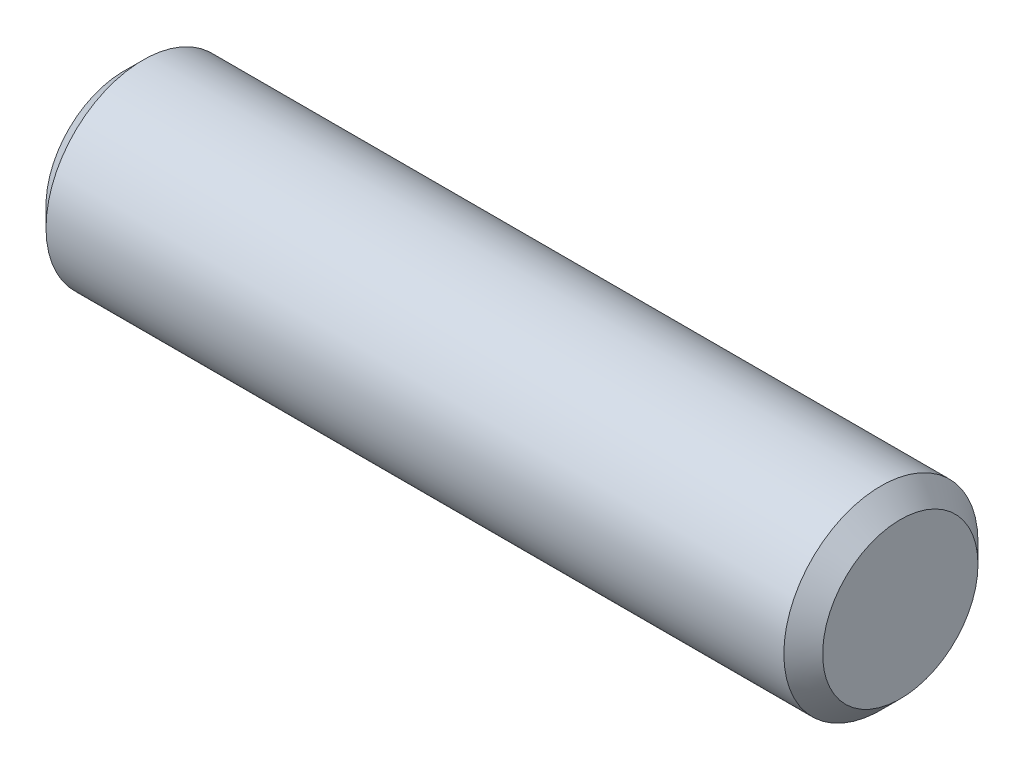
ISO-10303-21;
HEADER;
FILE_DESCRIPTION(('STEP AP214'),'2;1');
FILE_NAME('part.step','',(''),(''),'','','');
FILE_SCHEMA(('AUTOMOTIVE_DESIGN { 1 0 10303 214 1 1 1 1 }'));
ENDSEC;
DATA;
#1=APPLICATION_CONTEXT('core data for automotive mechanical design processes');
#2=APPLICATION_PROTOCOL_DEFINITION('international standard','automotive_design',2000,#1);
#3=PRODUCT_CONTEXT('',#1,'mechanical');
#4=PRODUCT('Part','Part','',(#3));
#5=PRODUCT_RELATED_PRODUCT_CATEGORY('part','',(#4));
#6=PRODUCT_DEFINITION_FORMATION('','',#4);
#7=PRODUCT_DEFINITION_CONTEXT('part definition',#1,'design');
#8=PRODUCT_DEFINITION('design','',#6,#7);
#9=PRODUCT_DEFINITION_SHAPE('','',#8);
#10=(LENGTH_UNIT() NAMED_UNIT(*) SI_UNIT(.MILLI.,.METRE.));
#11=(NAMED_UNIT(*) PLANE_ANGLE_UNIT() SI_UNIT($,.RADIAN.));
#12=(NAMED_UNIT(*) SI_UNIT($,.STERADIAN.) SOLID_ANGLE_UNIT());
#13=UNCERTAINTY_MEASURE_WITH_UNIT(LENGTH_MEASURE(1.E-05),#10,'distance_accuracy_value','');
#14=(GEOMETRIC_REPRESENTATION_CONTEXT(3) GLOBAL_UNCERTAINTY_ASSIGNED_CONTEXT((#13)) GLOBAL_UNIT_ASSIGNED_CONTEXT((#10,
#11,#12)) REPRESENTATION_CONTEXT('',''));
#15=CARTESIAN_POINT('',(0.,0.,0.));
#16=DIRECTION('',(0.,0.,1.));
#17=DIRECTION('',(1.,0.,0.));
#18=AXIS2_PLACEMENT_3D('',#15,#16,#17);
#19=CARTESIAN_POINT('',(-12.7,0.,0.));
#20=DIRECTION('',(1.,0.,0.));
#21=DIRECTION('',(0.,0.,-1.));
#22=AXIS2_PLACEMENT_3D('',#19,#20,#21);
#23=CYLINDRICAL_SURFACE('',#22,3.175);
#24=CARTESIAN_POINT('',(12.065,0.,0.));
#25=DIRECTION('',(1.,0.,0.));
#26=DIRECTION('',(0.,0.,-1.));
#27=AXIS2_PLACEMENT_3D('',#24,#25,#26);
#28=CIRCLE('',#27,3.175);
#29=CARTESIAN_POINT('',(12.065,0.,-3.175));
#30=VERTEX_POINT('',#29);
#31=EDGE_CURVE('E54',#30,#30,#28,.F.);
#32=ORIENTED_EDGE('',*,*,#31,.T.);
#33=EDGE_LOOP('',(#32));
#34=FACE_BOUND('',#33,.T.);
#35=CARTESIAN_POINT('',(-12.065,0.,0.));
#36=DIRECTION('',(1.,0.,0.));
#37=DIRECTION('',(0.,0.,-1.));
#38=AXIS2_PLACEMENT_3D('',#35,#36,#37);
#39=CIRCLE('',#38,3.175);
#40=CARTESIAN_POINT('',(-12.065,0.,-3.175));
#41=VERTEX_POINT('',#40);
#42=EDGE_CURVE('E58',#41,#41,#39,.T.);
#43=ORIENTED_EDGE('',*,*,#42,.T.);
#44=EDGE_LOOP('',(#43));
#45=FACE_BOUND('',#44,.T.);
#46=ADVANCED_FACE('F47',(#34,#45),#23,.T.);
#47=CARTESIAN_POINT('',(-12.7,0.,0.));
#48=DIRECTION('',(1.,0.,0.));
#49=DIRECTION('',(0.,0.,-1.));
#50=AXIS2_PLACEMENT_3D('',#47,#48,#49);
#51=PLANE('',#50);
#52=CARTESIAN_POINT('',(-12.7,0.,0.));
#53=DIRECTION('',(1.,0.,0.));
#54=DIRECTION('',(0.,0.,-1.));
#55=AXIS2_PLACEMENT_3D('',#52,#53,#54);
#56=CIRCLE('',#55,2.54);
#57=CARTESIAN_POINT('',(-12.7,0.,-2.54));
#58=VERTEX_POINT('',#57);
#59=EDGE_CURVE('E12',#58,#58,#56,.F.);
#60=ORIENTED_EDGE('',*,*,#59,.T.);
#61=EDGE_LOOP('',(#60));
#62=FACE_BOUND('',#61,.T.);
#63=ADVANCED_FACE('F78',(#62),#51,.F.);
#64=CARTESIAN_POINT('',(12.7,0.,0.));
#65=DIRECTION('',(1.,0.,0.));
#66=DIRECTION('',(0.,0.,-1.));
#67=AXIS2_PLACEMENT_3D('',#64,#65,#66);
#68=PLANE('',#67);
#69=CARTESIAN_POINT('',(12.7,0.,0.));
#70=DIRECTION('',(1.,0.,0.));
#71=DIRECTION('',(0.,0.,-1.));
#72=AXIS2_PLACEMENT_3D('',#69,#70,#71);
#73=CIRCLE('',#72,2.54);
#74=CARTESIAN_POINT('',(12.7,0.,-2.54));
#75=VERTEX_POINT('',#74);
#76=EDGE_CURVE('E62',#75,#75,#73,.T.);
#77=ORIENTED_EDGE('',*,*,#76,.T.);
#78=EDGE_LOOP('',(#77));
#79=FACE_BOUND('',#78,.T.);
#80=ADVANCED_FACE('F68',(#79),#68,.T.);
#81=CARTESIAN_POINT('',(12.7,0.,0.));
#82=DIRECTION('',(-1.,0.,0.));
#83=DIRECTION('',(0.,0.,1.));
#84=AXIS2_PLACEMENT_3D('',#81,#82,#83);
#85=CONICAL_SURFACE('',#84,2.54,0.785398163397445);
#86=ORIENTED_EDGE('',*,*,#31,.F.);
#87=EDGE_LOOP('',(#86));
#88=FACE_BOUND('',#87,.T.);
#89=ORIENTED_EDGE('',*,*,#76,.F.);
#90=EDGE_LOOP('',(#89));
#91=FACE_BOUND('',#90,.T.);
#92=ADVANCED_FACE('F70',(#88,#91),#85,.T.);
#93=CARTESIAN_POINT('',(-12.065,0.,0.));
#94=DIRECTION('',(1.,0.,0.));
#95=DIRECTION('',(0.,0.,-1.));
#96=AXIS2_PLACEMENT_3D('',#93,#94,#95);
#97=CONICAL_SURFACE('',#96,3.175,0.785398163397448);
#98=ORIENTED_EDGE('',*,*,#59,.F.);
#99=EDGE_LOOP('',(#98));
#100=FACE_BOUND('',#99,.T.);
#101=ORIENTED_EDGE('',*,*,#42,.F.);
#102=EDGE_LOOP('',(#101));
#103=FACE_BOUND('',#102,.T.);
#104=ADVANCED_FACE('F49',(#100,#103),#97,.T.);
#105=CLOSED_SHELL('',(#46,#63,#80,#92,#104));
#106=MANIFOLD_SOLID_BREP('B2',#105);
#107=ADVANCED_BREP_SHAPE_REPRESENTATION('',(#18,#106),#14);
#108=SHAPE_DEFINITION_REPRESENTATION(#9,#107);
ENDSEC;
END-ISO-10303-21;
